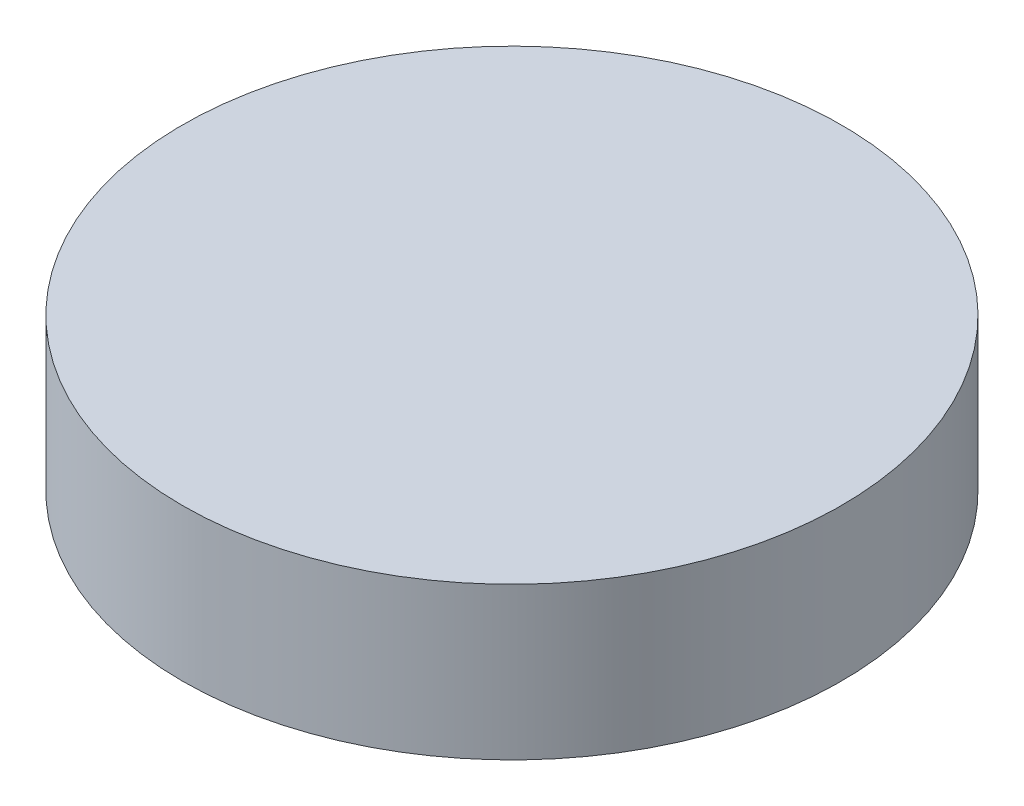
ISO-10303-21;
HEADER;
FILE_DESCRIPTION(('STEP AP214'),'2;1');
FILE_NAME('part.step','',(''),(''),'','','');
FILE_SCHEMA(('AUTOMOTIVE_DESIGN { 1 0 10303 214 1 1 1 1 }'));
ENDSEC;
DATA;
#1=APPLICATION_CONTEXT('core data for automotive mechanical design processes');
#2=APPLICATION_PROTOCOL_DEFINITION('international standard','automotive_design',2000,#1);
#3=PRODUCT_CONTEXT('',#1,'mechanical');
#4=PRODUCT('Part','Part','',(#3));
#5=PRODUCT_RELATED_PRODUCT_CATEGORY('part','',(#4));
#6=PRODUCT_DEFINITION_FORMATION('','',#4);
#7=PRODUCT_DEFINITION_CONTEXT('part definition',#1,'design');
#8=PRODUCT_DEFINITION('design','',#6,#7);
#9=PRODUCT_DEFINITION_SHAPE('','',#8);
#10=(LENGTH_UNIT() NAMED_UNIT(*) SI_UNIT(.MILLI.,.METRE.));
#11=(NAMED_UNIT(*) PLANE_ANGLE_UNIT() SI_UNIT($,.RADIAN.));
#12=(NAMED_UNIT(*) SI_UNIT($,.STERADIAN.) SOLID_ANGLE_UNIT());
#13=UNCERTAINTY_MEASURE_WITH_UNIT(LENGTH_MEASURE(1.E-05),#10,'distance_accuracy_value','');
#14=(GEOMETRIC_REPRESENTATION_CONTEXT(3) GLOBAL_UNCERTAINTY_ASSIGNED_CONTEXT((#13)) GLOBAL_UNIT_ASSIGNED_CONTEXT((#10,
#11,#12)) REPRESENTATION_CONTEXT('',''));
#15=CARTESIAN_POINT('',(0.,0.,0.));
#16=DIRECTION('',(0.,0.,1.));
#17=DIRECTION('',(1.,0.,0.));
#18=AXIS2_PLACEMENT_3D('',#15,#16,#17);
#19=CARTESIAN_POINT('',(0.,30.,0.));
#20=DIRECTION('',(0.,-1.,0.));
#21=DIRECTION('',(0.,0.,-1.));
#22=AXIS2_PLACEMENT_3D('',#19,#20,#21);
#23=CYLINDRICAL_SURFACE('',#22,65.);
#24=CARTESIAN_POINT('',(0.,30.,0.));
#25=DIRECTION('',(0.,1.,0.));
#26=DIRECTION('',(0.,0.,1.));
#27=AXIS2_PLACEMENT_3D('',#24,#25,#26);
#28=CIRCLE('',#27,65.);
#29=CARTESIAN_POINT('',(0.,30.,65.));
#30=VERTEX_POINT('',#29);
#31=EDGE_CURVE('E10',#30,#30,#28,.T.);
#32=ORIENTED_EDGE('',*,*,#31,.F.);
#33=EDGE_LOOP('',(#32));
#34=FACE_BOUND('',#33,.T.);
#35=CARTESIAN_POINT('',(0.,0.,0.));
#36=DIRECTION('',(0.,1.,0.));
#37=DIRECTION('',(0.,0.,1.));
#38=AXIS2_PLACEMENT_3D('',#35,#36,#37);
#39=CIRCLE('',#38,65.);
#40=CARTESIAN_POINT('',(0.,0.,65.));
#41=VERTEX_POINT('',#40);
#42=EDGE_CURVE('E36',#41,#41,#39,.T.);
#43=ORIENTED_EDGE('',*,*,#42,.T.);
#44=EDGE_LOOP('',(#43));
#45=FACE_BOUND('',#44,.T.);
#46=ADVANCED_FACE('F30',(#34,#45),#23,.T.);
#47=CARTESIAN_POINT('',(0.,30.,0.));
#48=DIRECTION('',(0.,1.,0.));
#49=DIRECTION('',(0.,0.,1.));
#50=AXIS2_PLACEMENT_3D('',#47,#48,#49);
#51=PLANE('',#50);
#52=ORIENTED_EDGE('',*,*,#31,.T.);
#53=EDGE_LOOP('',(#52));
#54=FACE_BOUND('',#53,.T.);
#55=ADVANCED_FACE('F45',(#54),#51,.T.);
#56=CARTESIAN_POINT('',(0.,0.,0.));
#57=DIRECTION('',(0.,1.,0.));
#58=DIRECTION('',(0.,0.,1.));
#59=AXIS2_PLACEMENT_3D('',#56,#57,#58);
#60=PLANE('',#59);
#61=ORIENTED_EDGE('',*,*,#42,.F.);
#62=EDGE_LOOP('',(#61));
#63=FACE_BOUND('',#62,.T.);
#64=ADVANCED_FACE('F43',(#63),#60,.F.);
#65=CLOSED_SHELL('',(#46,#55,#64));
#66=MANIFOLD_SOLID_BREP('B2',#65);
#67=ADVANCED_BREP_SHAPE_REPRESENTATION('',(#18,#66),#14);
#68=SHAPE_DEFINITION_REPRESENTATION(#9,#67);
ENDSEC;
END-ISO-10303-21;
